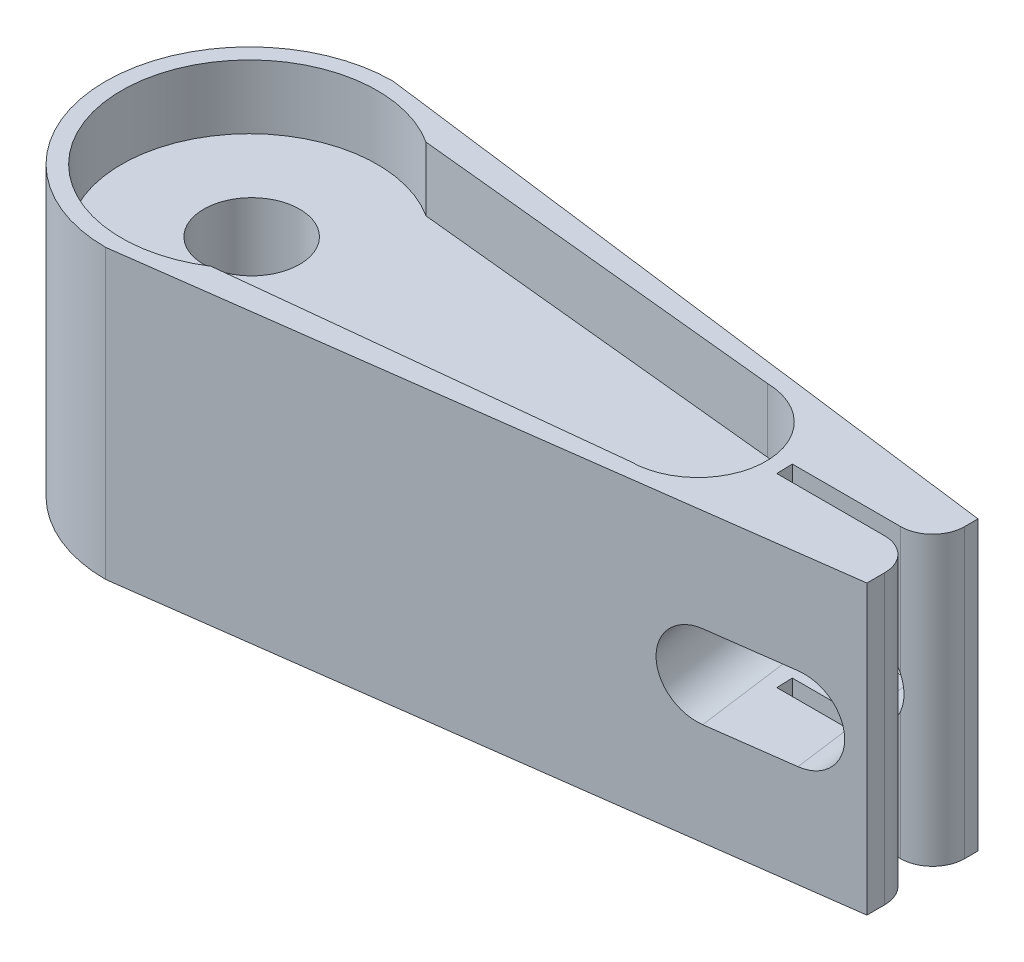
ISO-10303-21;
HEADER;
FILE_DESCRIPTION(('STEP AP214'),'2;1');
FILE_NAME('part.step','',(''),(''),'','','');
FILE_SCHEMA(('AUTOMOTIVE_DESIGN { 1 0 10303 214 1 1 1 1 }'));
ENDSEC;
DATA;
#1=APPLICATION_CONTEXT('core data for automotive mechanical design processes');
#2=APPLICATION_PROTOCOL_DEFINITION('international standard','automotive_design',2000,#1);
#3=PRODUCT_CONTEXT('',#1,'mechanical');
#4=PRODUCT('Part','Part','',(#3));
#5=PRODUCT_RELATED_PRODUCT_CATEGORY('part','',(#4));
#6=PRODUCT_DEFINITION_FORMATION('','',#4);
#7=PRODUCT_DEFINITION_CONTEXT('part definition',#1,'design');
#8=PRODUCT_DEFINITION('design','',#6,#7);
#9=PRODUCT_DEFINITION_SHAPE('','',#8);
#10=(LENGTH_UNIT() NAMED_UNIT(*) SI_UNIT(.MILLI.,.METRE.));
#11=(NAMED_UNIT(*) PLANE_ANGLE_UNIT() SI_UNIT($,.RADIAN.));
#12=(NAMED_UNIT(*) SI_UNIT($,.STERADIAN.) SOLID_ANGLE_UNIT());
#13=UNCERTAINTY_MEASURE_WITH_UNIT(LENGTH_MEASURE(1.E-05),#10,'distance_accuracy_value','');
#14=(GEOMETRIC_REPRESENTATION_CONTEXT(3) GLOBAL_UNCERTAINTY_ASSIGNED_CONTEXT((#13)) GLOBAL_UNIT_ASSIGNED_CONTEXT((#10,
#11,#12)) REPRESENTATION_CONTEXT('',''));
#15=CARTESIAN_POINT('',(0.,0.,0.));
#16=DIRECTION('',(0.,0.,1.));
#17=DIRECTION('',(1.,0.,0.));
#18=AXIS2_PLACEMENT_3D('',#15,#16,#17);
#19=CARTESIAN_POINT('',(-10.3510938888808,9.,0.338638234521338));
#20=DIRECTION('',(0.999465286624354,0.,-0.0326977190779233));
#21=DIRECTION('',(-0.0326977190779233,0.,-0.999465286624354));
#22=AXIS2_PLACEMENT_3D('',#19,#20,#21);
#23=PLANE('',#22);
#24=DIRECTION('',(-0.0326977190779233,0.,-0.999465286624354));
#25=VECTOR('',#24,1.);
#26=CARTESIAN_POINT('',(-10.3510938888808,3.2,0.338638234521338));
#27=LINE('',#26,#25);
#28=CARTESIAN_POINT('',(-10.3556294681616,3.2,0.200000000000035));
#29=VERTEX_POINT('',#28);
#30=CARTESIAN_POINT('',(-10.3719870743314,3.2,-0.300000000000064));
#31=VERTEX_POINT('',#30);
#32=EDGE_CURVE('E438',#29,#31,#27,.T.);
#33=ORIENTED_EDGE('',*,*,#32,.F.);
#34=DIRECTION('',(0.,-1.,0.));
#35=VECTOR('',#34,1.);
#36=CARTESIAN_POINT('',(-10.3556294681616,9.,0.200000000000035));
#37=LINE('',#36,#35);
#38=CARTESIAN_POINT('',(-10.3556294681616,0.,0.200000000000035));
#39=VERTEX_POINT('',#38);
#40=EDGE_CURVE('E311',#29,#39,#37,.T.);
#41=ORIENTED_EDGE('',*,*,#40,.T.);
#42=DIRECTION('',(0.0326977190779233,0.,0.999465286624354));
#43=VECTOR('',#42,1.);
#44=CARTESIAN_POINT('',(-10.3510938888808,0.,0.338638234521338));
#45=LINE('',#44,#43);
#46=CARTESIAN_POINT('',(-10.3719870743314,0.,-0.300000000000064));
#47=VERTEX_POINT('',#46);
#48=EDGE_CURVE('E452',#47,#39,#45,.T.);
#49=ORIENTED_EDGE('',*,*,#48,.F.);
#50=DIRECTION('',(0.,-1.,0.));
#51=VECTOR('',#50,1.);
#52=CARTESIAN_POINT('',(-10.3719870743314,9.,-0.300000000000064));
#53=LINE('',#52,#51);
#54=EDGE_CURVE('E344',#31,#47,#53,.T.);
#55=ORIENTED_EDGE('',*,*,#54,.F.);
#56=EDGE_LOOP('',(#33,#41,#49,#55));
#57=FACE_BOUND('',#56,.T.);
#58=ADVANCED_FACE('F45',(#57),#23,.T.);
#59=CARTESIAN_POINT('',(0.,9.,-0.299999999999906));
#60=DIRECTION('',(0.,0.,1.));
#61=DIRECTION('',(1.,0.,0.));
#62=AXIS2_PLACEMENT_3D('',#59,#60,#61);
#63=PLANE('',#62);
#64=CARTESIAN_POINT('',(-8.19153680982325,4.5,-0.300000000000031));
#65=DIRECTION('',(0.,0.,1.));
#66=DIRECTION('',(1.,0.,0.));
#67=AXIS2_PLACEMENT_3D('',#64,#65,#66);
#68=ELLIPSE('',#67,1.31161285612062,1.3);
#69=CARTESIAN_POINT('',(-8.19153680982325,3.2,-0.300000000000031));
#70=VERTEX_POINT('',#69);
#71=CARTESIAN_POINT('',(-6.98015973110085,4.00156695437617,-0.300000000000012));
#72=VERTEX_POINT('',#71);
#73=EDGE_CURVE('E247',#70,#72,#68,.T.);
#74=ORIENTED_EDGE('',*,*,#73,.F.);
#75=DIRECTION('',(1.,0.,0.));
#76=VECTOR('',#75,1.);
#77=CARTESIAN_POINT('',(0.,3.2,-0.299999999999906));
#78=LINE('',#77,#76);
#79=EDGE_CURVE('E444',#31,#70,#78,.T.);
#80=ORIENTED_EDGE('',*,*,#79,.F.);
#81=ORIENTED_EDGE('',*,*,#54,.T.);
#82=DIRECTION('',(-1.,0.,0.));
#83=VECTOR('',#82,1.);
#84=CARTESIAN_POINT('',(0.,0.,-0.299999999999906));
#85=LINE('',#84,#83);
#86=CARTESIAN_POINT('',(-6.98015973110085,0.,-0.300000000000012));
#87=VERTEX_POINT('',#86);
#88=EDGE_CURVE('E422',#87,#47,#85,.T.);
#89=ORIENTED_EDGE('',*,*,#88,.F.);
#90=DIRECTION('',(0.,-1.,0.));
#91=VECTOR('',#90,1.);
#92=CARTESIAN_POINT('',(-6.98015973110085,9.,-0.300000000000012));
#93=LINE('',#92,#91);
#94=EDGE_CURVE('E281',#87,#72,#93,.F.);
#95=ORIENTED_EDGE('',*,*,#94,.T.);
#96=EDGE_LOOP('',(#74,#80,#81,#89,#95));
#97=FACE_BOUND('',#96,.T.);
#98=ADVANCED_FACE('F419',(#97),#63,.T.);
#99=CARTESIAN_POINT('',(0.,9.,0.199999999999957));
#100=DIRECTION('',(0.,0.,-1.));
#101=DIRECTION('',(-1.,0.,0.));
#102=AXIS2_PLACEMENT_3D('',#99,#100,#101);
#103=PLANE('',#102);
#104=CARTESIAN_POINT('',(-8.12455597230381,4.5,0.200000000000018));
#105=DIRECTION('',(0.,0.,-1.));
#106=DIRECTION('',(1.,0.,0.));
#107=AXIS2_PLACEMENT_3D('',#104,#105,#106);
#108=ELLIPSE('',#107,1.31161285612062,1.3);
#109=CARTESIAN_POINT('',(-6.98012046216751,3.86489598525478,0.20000000000001));
#110=VERTEX_POINT('',#109);
#111=CARTESIAN_POINT('',(-8.12455597230381,3.2,0.200000000000018));
#112=VERTEX_POINT('',#111);
#113=EDGE_CURVE('E256',#110,#112,#108,.T.);
#114=ORIENTED_EDGE('',*,*,#113,.F.);
#115=DIRECTION('',(0.,-1.,0.));
#116=VECTOR('',#115,1.);
#117=CARTESIAN_POINT('',(-6.98012046216751,9.,0.20000000000001));
#118=LINE('',#117,#116);
#119=CARTESIAN_POINT('',(-6.98012046216751,0.,0.20000000000001));
#120=VERTEX_POINT('',#119);
#121=EDGE_CURVE('E380',#110,#120,#118,.T.);
#122=ORIENTED_EDGE('',*,*,#121,.T.);
#123=DIRECTION('',(1.,0.,0.));
#124=VECTOR('',#123,1.);
#125=CARTESIAN_POINT('',(0.,0.,0.199999999999957));
#126=LINE('',#125,#124);
#127=EDGE_CURVE('E313',#39,#120,#126,.T.);
#128=ORIENTED_EDGE('',*,*,#127,.F.);
#129=ORIENTED_EDGE('',*,*,#40,.F.);
#130=DIRECTION('',(-1.,0.,0.));
#131=VECTOR('',#130,1.);
#132=CARTESIAN_POINT('',(0.,3.2,0.199999999999957));
#133=LINE('',#132,#131);
#134=EDGE_CURVE('E11',#112,#29,#133,.T.);
#135=ORIENTED_EDGE('',*,*,#134,.F.);
#136=EDGE_LOOP('',(#114,#122,#128,#129,#135));
#137=FACE_BOUND('',#136,.T.);
#138=ADVANCED_FACE('F309',(#137),#103,.T.);
#139=CARTESIAN_POINT('',(-26.9871144134073,7.,0.));
#140=DIRECTION('',(0.,-1.,0.));
#141=DIRECTION('',(0.,0.,-1.));
#142=AXIS2_PLACEMENT_3D('',#139,#140,#141);
#143=CYLINDRICAL_SURFACE('',#142,1.5);
#144=CARTESIAN_POINT('',(-26.9871144134073,7.,0.));
#145=DIRECTION('',(0.,1.,0.));
#146=DIRECTION('',(0.,0.,1.));
#147=AXIS2_PLACEMENT_3D('',#144,#145,#146);
#148=CIRCLE('',#147,1.5);
#149=CARTESIAN_POINT('',(-26.9871144134073,7.,1.5));
#150=VERTEX_POINT('',#149);
#151=EDGE_CURVE('E361',#150,#150,#148,.T.);
#152=ORIENTED_EDGE('',*,*,#151,.T.);
#153=EDGE_LOOP('',(#152));
#154=FACE_BOUND('',#153,.T.);
#155=CARTESIAN_POINT('',(-26.9871144134073,0.,0.));
#156=DIRECTION('',(0.,1.,0.));
#157=DIRECTION('',(0.,0.,1.));
#158=AXIS2_PLACEMENT_3D('',#155,#156,#157);
#159=CIRCLE('',#158,1.5);
#160=CARTESIAN_POINT('',(-26.9871144134073,0.,1.5));
#161=VERTEX_POINT('',#160);
#162=EDGE_CURVE('E349',#161,#161,#159,.T.);
#163=ORIENTED_EDGE('',*,*,#162,.F.);
#164=EDGE_LOOP('',(#163));
#165=FACE_BOUND('',#164,.T.);
#166=ADVANCED_FACE('F562',(#154,#165),#143,.F.);
#167=CARTESIAN_POINT('',(0.,7.,0.));
#168=DIRECTION('',(0.,1.,0.));
#169=DIRECTION('',(0.,0.,1.));
#170=AXIS2_PLACEMENT_3D('',#167,#168,#169);
#171=PLANE('',#170);
#172=ORIENTED_EDGE('',*,*,#151,.F.);
#173=EDGE_LOOP('',(#172));
#174=FACE_BOUND('',#173,.T.);
#175=CARTESIAN_POINT('',(-26.9871144111105,7.,0.0716479314063977));
#176=DIRECTION('',(0.,1.,0.));
#177=DIRECTION('',(0.,0.,1.));
#178=AXIS2_PLACEMENT_3D('',#175,#176,#177);
#179=CIRCLE('',#178,4.00017684495756);
#180=CARTESIAN_POINT('',(-24.8217817734605,7.,-3.29179514961377));
#181=VERTEX_POINT('',#180);
#182=CARTESIAN_POINT('',(-24.8217479106025,7.,3.43506921180117));
#183=VERTEX_POINT('',#182);
#184=EDGE_CURVE('E365',#181,#183,#179,.T.);
#185=ORIENTED_EDGE('',*,*,#184,.T.);
#186=DIRECTION('',(-0.994303481764952,0.,0.10658605044796));
#187=VECTOR('',#186,1.);
#188=CARTESIAN_POINT('',(0.0820551859234197,7.,0.765463742371819));
#189=LINE('',#188,#187);
#190=CARTESIAN_POINT('',(-12.9871602464953,7.,2.16644048734145));
#191=VERTEX_POINT('',#190);
#192=EDGE_CURVE('E369',#191,#183,#189,.T.);
#193=ORIENTED_EDGE('',*,*,#192,.F.);
#194=CARTESIAN_POINT('',(-12.9871602464953,7.,0.0358235169116221));
#195=DIRECTION('',(0.,1.,0.));
#196=DIRECTION('',(0.,0.,1.));
#197=AXIS2_PLACEMENT_3D('',#194,#195,#196);
#198=CIRCLE('',#197,2.13061697043081);
#199=CARTESIAN_POINT('',(-12.9397621783685,7.,-2.09426617552422));
#200=VERTEX_POINT('',#199);
#201=EDGE_CURVE('E373',#191,#200,#198,.T.);
#202=ORIENTED_EDGE('',*,*,#201,.T.);
#203=DIRECTION('',(0.994959561797014,0.,0.100276968386042));
#204=VECTOR('',#203,1.);
#205=CARTESIAN_POINT('',(0.0788327420462111,7.,-0.782187492741088));
#206=LINE('',#205,#204);
#207=EDGE_CURVE('E377',#181,#200,#206,.T.);
#208=ORIENTED_EDGE('',*,*,#207,.F.);
#209=EDGE_LOOP('',(#185,#193,#202,#208));
#210=FACE_BOUND('',#209,.T.);
#211=ADVANCED_FACE('F551',(#174,#210),#171,.T.);
#212=CARTESIAN_POINT('',(0.,0.,0.));
#213=DIRECTION('',(0.,1.,0.));
#214=DIRECTION('',(0.,0.,1.));
#215=AXIS2_PLACEMENT_3D('',#212,#213,#214);
#216=PLANE('',#215);
#217=ORIENTED_EDGE('',*,*,#162,.T.);
#218=EDGE_LOOP('',(#217));
#219=FACE_BOUND('',#218,.T.);
#220=ORIENTED_EDGE('',*,*,#127,.T.);
#221=CARTESIAN_POINT('',(-6.9801204621675,0.,1.20000000000001));
#222=DIRECTION('',(0.,1.,0.));
#223=DIRECTION('',(0.,0.,1.));
#224=AXIS2_PLACEMENT_3D('',#221,#222,#223);
#225=CIRCLE('',#224,1.);
#226=CARTESIAN_POINT('',(-5.9801204779192,0.,1.19982250800737));
#227=VERTEX_POINT('',#226);
#228=EDGE_CURVE('E389',#120,#227,#225,.F.);
#229=ORIENTED_EDGE('',*,*,#228,.T.);
#230=DIRECTION('',(0.000177491992637757,0.,0.999999984248296));
#231=VECTOR('',#230,1.);
#232=CARTESIAN_POINT('',(-5.98033324840943,0.,0.00106146128161784));
#233=LINE('',#232,#231);
#234=CARTESIAN_POINT('',(-5.98002152379045,0.,1.75733569898175));
#235=VERTEX_POINT('',#234);
#236=EDGE_CURVE('E512',#227,#235,#233,.T.);
#237=ORIENTED_EDGE('',*,*,#236,.T.);
#238=DIRECTION('',(0.991146125118836,0.,-0.13277559512921));
#239=VECTOR('',#238,1.);
#240=CARTESIAN_POINT('',(0.125841462948721,0.,0.939384065720302));
#241=LINE('',#240,#239);
#242=CARTESIAN_POINT('',(-26.9871144111105,0.,4.5714810498644));
#243=VERTEX_POINT('',#242);
#244=EDGE_CURVE('E509',#243,#235,#241,.T.);
#245=ORIENTED_EDGE('',*,*,#244,.F.);
#246=CARTESIAN_POINT('',(-26.9871144111105,0.,0.0716479314063977));
#247=DIRECTION('',(0.,1.,0.));
#248=DIRECTION('',(0.,0.,1.));
#249=AXIS2_PLACEMENT_3D('',#246,#247,#248);
#250=CIRCLE('',#249,4.499833118458);
#251=CARTESIAN_POINT('',(-26.9871144111105,0.,-4.4281851870516));
#252=VERTEX_POINT('',#251);
#253=EDGE_CURVE('E505',#252,#243,#250,.T.);
#254=ORIENTED_EDGE('',*,*,#253,.F.);
#255=DIRECTION('',(0.991786141384125,0.,0.127907191972889));
#256=VECTOR('',#255,1.);
#257=CARTESIAN_POINT('',(0.120228498103905,0.,-0.932245922841887));
#258=LINE('',#257,#256);
#259=CARTESIAN_POINT('',(-5.98015973110084,0.,-1.71899166951373));
#260=VERTEX_POINT('',#259);
#261=EDGE_CURVE('E501',#252,#260,#258,.T.);
#262=ORIENTED_EDGE('',*,*,#261,.T.);
#263=DIRECTION('',(0.,0.,-1.));
#264=VECTOR('',#263,1.);
#265=CARTESIAN_POINT('',(-5.98015973110084,0.,0.));
#266=LINE('',#265,#264);
#267=CARTESIAN_POINT('',(-5.98015973110084,0.,-1.30000000000001));
#268=VERTEX_POINT('',#267);
#269=EDGE_CURVE('E498',#268,#260,#266,.T.);
#270=ORIENTED_EDGE('',*,*,#269,.F.);
#271=CARTESIAN_POINT('',(-6.98015973110084,0.,-1.30000000000001));
#272=DIRECTION('',(0.,1.,0.));
#273=DIRECTION('',(0.,0.,1.));
#274=AXIS2_PLACEMENT_3D('',#271,#272,#273);
#275=CIRCLE('',#274,1.);
#276=EDGE_CURVE('E386',#268,#87,#275,.F.);
#277=ORIENTED_EDGE('',*,*,#276,.T.);
#278=ORIENTED_EDGE('',*,*,#88,.T.);
#279=ORIENTED_EDGE('',*,*,#48,.T.);
#280=EDGE_LOOP('',(#220,#229,#237,#245,#254,#262,#270,#277,#278,#279));
#281=FACE_BOUND('',#280,.T.);
#282=ADVANCED_FACE('F517',(#219,#281),#216,.F.);
#283=DIRECTION('',(0.0326977190779233,0.,0.999465286624354));
#284=VECTOR('',#283,1.);
#285=CARTESIAN_POINT('',(-10.3510938888808,5.8,0.338638234521338));
#286=LINE('',#285,#284);
#287=CARTESIAN_POINT('',(-10.3719870743314,5.8,-0.300000000000064));
#288=VERTEX_POINT('',#287);
#289=CARTESIAN_POINT('',(-10.3556294681616,5.8,0.200000000000035));
#290=VERTEX_POINT('',#289);
#291=EDGE_CURVE('E286',#288,#290,#286,.T.);
#292=ORIENTED_EDGE('',*,*,#291,.F.);
#293=CARTESIAN_POINT('',(-10.3719870743314,9.,-0.300000000000064));
#294=VERTEX_POINT('',#293);
#295=EDGE_CURVE('E345',#294,#288,#53,.T.);
#296=ORIENTED_EDGE('',*,*,#295,.F.);
#297=DIRECTION('',(0.0326977190779233,0.,0.999465286624354));
#298=VECTOR('',#297,1.);
#299=CARTESIAN_POINT('',(-10.3510938888808,9.,0.338638234521338));
#300=LINE('',#299,#298);
#301=CARTESIAN_POINT('',(-10.3556294681616,9.,0.200000000000035));
#302=VERTEX_POINT('',#301);
#303=EDGE_CURVE('E467',#294,#302,#300,.T.);
#304=ORIENTED_EDGE('',*,*,#303,.T.);
#305=EDGE_CURVE('E318',#302,#290,#37,.T.);
#306=ORIENTED_EDGE('',*,*,#305,.T.);
#307=EDGE_LOOP('',(#292,#296,#304,#306));
#308=FACE_BOUND('',#307,.T.);
#309=ADVANCED_FACE('F543',(#308),#23,.T.);
#310=CARTESIAN_POINT('',(-6.98015973110085,4.99843304562384,-0.300000000000012));
#311=VERTEX_POINT('',#310);
#312=CARTESIAN_POINT('',(-8.19153680982325,5.8,-0.300000000000031));
#313=VERTEX_POINT('',#312);
#314=EDGE_CURVE('E244',#311,#313,#68,.T.);
#315=ORIENTED_EDGE('',*,*,#314,.F.);
#316=CARTESIAN_POINT('',(-6.98015973110085,9.,-0.300000000000012));
#317=VERTEX_POINT('',#316);
#318=EDGE_CURVE('E403',#311,#317,#93,.F.);
#319=ORIENTED_EDGE('',*,*,#318,.T.);
#320=DIRECTION('',(-1.,0.,0.));
#321=VECTOR('',#320,1.);
#322=CARTESIAN_POINT('',(0.,9.,-0.299999999999906));
#323=LINE('',#322,#321);
#324=EDGE_CURVE('E471',#317,#294,#323,.T.);
#325=ORIENTED_EDGE('',*,*,#324,.T.);
#326=ORIENTED_EDGE('',*,*,#295,.T.);
#327=DIRECTION('',(-1.,0.,0.));
#328=VECTOR('',#327,1.);
#329=CARTESIAN_POINT('',(0.,5.80000000000001,-0.299999999999906));
#330=LINE('',#329,#328);
#331=EDGE_CURVE('E431',#313,#288,#330,.T.);
#332=ORIENTED_EDGE('',*,*,#331,.F.);
#333=EDGE_LOOP('',(#315,#319,#325,#326,#332));
#334=FACE_BOUND('',#333,.T.);
#335=ADVANCED_FACE('F430',(#334),#63,.T.);
#336=CARTESIAN_POINT('',(-5.98015973110084,9.,0.));
#337=DIRECTION('',(-1.,0.,0.));
#338=DIRECTION('',(0.,0.,1.));
#339=AXIS2_PLACEMENT_3D('',#336,#337,#338);
#340=PLANE('',#339);
#341=DIRECTION('',(0.,0.,-1.));
#342=VECTOR('',#341,1.);
#343=CARTESIAN_POINT('',(-5.98015973110084,9.,0.));
#344=LINE('',#343,#342);
#345=CARTESIAN_POINT('',(-5.98015973110084,9.,-1.30000000000001));
#346=VERTEX_POINT('',#345);
#347=CARTESIAN_POINT('',(-5.98015973110084,9.,-1.71899166951373));
#348=VERTEX_POINT('',#347);
#349=EDGE_CURVE('E474',#346,#348,#344,.T.);
#350=ORIENTED_EDGE('',*,*,#349,.F.);
#351=DIRECTION('',(0.,-1.,0.));
#352=VECTOR('',#351,1.);
#353=CARTESIAN_POINT('',(-5.98015973110084,0.,-1.30000000000001));
#354=LINE('',#353,#352);
#355=EDGE_CURVE('E400',#346,#268,#354,.T.);
#356=ORIENTED_EDGE('',*,*,#355,.T.);
#357=ORIENTED_EDGE('',*,*,#269,.T.);
#358=DIRECTION('',(0.,-1.,0.));
#359=VECTOR('',#358,1.);
#360=CARTESIAN_POINT('',(-5.98015973110084,9.,-1.71899166951373));
#361=LINE('',#360,#359);
#362=EDGE_CURVE('E340',#348,#260,#361,.T.);
#363=ORIENTED_EDGE('',*,*,#362,.F.);
#364=EDGE_LOOP('',(#350,#356,#357,#363));
#365=FACE_BOUND('',#364,.T.);
#366=ADVANCED_FACE('F540',(#365),#340,.F.);
#367=CARTESIAN_POINT('',(0.120228498103905,9.,-0.932245922841887));
#368=DIRECTION('',(0.127907191972889,0.,-0.991786141384124));
#369=DIRECTION('',(-0.991786141384125,0.,-0.127907191972889));
#370=AXIS2_PLACEMENT_3D('',#367,#368,#369);
#371=PLANE('',#370);
#372=CARTESIAN_POINT('',(-8.42384582205628,4.5,-2.03414532302325));
#373=DIRECTION('',(0.127907191972889,0.,-0.991786141384124));
#374=DIRECTION('',(0.991786141384125,0.,0.127907191972889));
#375=AXIS2_PLACEMENT_3D('',#372,#373,#374);
#376=ELLIPSE('',#375,1.3457249934378,1.3);
#377=CARTESIAN_POINT('',(-8.42384582205628,5.8,-2.03414532302325));
#378=VERTEX_POINT('',#377);
#379=CARTESIAN_POINT('',(-8.42384582205628,3.2,-2.03414532302325));
#380=VERTEX_POINT('',#379);
#381=EDGE_CURVE('E298',#378,#380,#376,.T.);
#382=ORIENTED_EDGE('',*,*,#381,.F.);
#383=DIRECTION('',(0.991786141384125,0.,0.127907191972889));
#384=VECTOR('',#383,1.);
#385=CARTESIAN_POINT('',(0.120228498103906,5.80000000000001,-0.932245922841887));
#386=LINE('',#385,#384);
#387=CARTESIAN_POINT('',(-11.1459864809552,5.8,-2.38521028885255));
#388=VERTEX_POINT('',#387);
#389=EDGE_CURVE('E434',#388,#378,#386,.T.);
#390=ORIENTED_EDGE('',*,*,#389,.F.);
#391=CARTESIAN_POINT('',(-11.1459864809552,4.5,-2.38521028885255));
#392=DIRECTION('',(0.127907191972889,0.,-0.991786141384124));
#393=DIRECTION('',(0.991786141384125,0.,0.127907191972889));
#394=AXIS2_PLACEMENT_3D('',#391,#392,#393);
#395=ELLIPSE('',#394,1.3457249934378,1.3);
#396=CARTESIAN_POINT('',(-11.1459864809552,3.2,-2.38521028885255));
#397=VERTEX_POINT('',#396);
#398=EDGE_CURVE('E213',#397,#388,#395,.T.);
#399=ORIENTED_EDGE('',*,*,#398,.F.);
#400=DIRECTION('',(-0.991786141384125,0.,-0.127907191972889));
#401=VECTOR('',#400,1.);
#402=CARTESIAN_POINT('',(0.120228498103904,3.2,-0.932245922841887));
#403=LINE('',#402,#401);
#404=EDGE_CURVE('E447',#380,#397,#403,.T.);
#405=ORIENTED_EDGE('',*,*,#404,.F.);
#406=EDGE_LOOP('',(#382,#390,#399,#405));
#407=FACE_BOUND('',#406,.T.);
#408=ORIENTED_EDGE('',*,*,#261,.F.);
#409=DIRECTION('',(0.,-1.,0.));
#410=VECTOR('',#409,1.);
#411=CARTESIAN_POINT('',(-26.9871144111105,9.,-4.4281851870516));
#412=LINE('',#411,#410);
#413=CARTESIAN_POINT('',(-26.9871144111105,9.,-4.4281851870516));
#414=VERTEX_POINT('',#413);
#415=EDGE_CURVE('E337',#414,#252,#412,.T.);
#416=ORIENTED_EDGE('',*,*,#415,.F.);
#417=DIRECTION('',(0.991786141384125,0.,0.127907191972889));
#418=VECTOR('',#417,1.);
#419=CARTESIAN_POINT('',(0.120228498103905,9.,-0.932245922841887));
#420=LINE('',#419,#418);
#421=EDGE_CURVE('E477',#414,#348,#420,.T.);
#422=ORIENTED_EDGE('',*,*,#421,.T.);
#423=ORIENTED_EDGE('',*,*,#362,.T.);
#424=EDGE_LOOP('',(#408,#416,#422,#423));
#425=FACE_BOUND('',#424,.T.);
#426=ADVANCED_FACE('F538',(#407,#425),#371,.T.);
#427=CARTESIAN_POINT('',(-26.9871144111105,9.,0.0716479314063977));
#428=DIRECTION('',(0.,-1.,0.));
#429=DIRECTION('',(0.,0.,-1.));
#430=AXIS2_PLACEMENT_3D('',#427,#428,#429);
#431=CYLINDRICAL_SURFACE('',#430,4.499833118458);
#432=ORIENTED_EDGE('',*,*,#253,.T.);
#433=DIRECTION('',(0.,-1.,0.));
#434=VECTOR('',#433,1.);
#435=CARTESIAN_POINT('',(-26.9871144111105,9.,4.5714810498644));
#436=LINE('',#435,#434);
#437=CARTESIAN_POINT('',(-26.9871144111105,9.,4.5714810498644));
#438=VERTEX_POINT('',#437);
#439=EDGE_CURVE('E333',#438,#243,#436,.T.);
#440=ORIENTED_EDGE('',*,*,#439,.F.);
#441=CARTESIAN_POINT('',(-26.9871144111105,9.,0.0716479314063977));
#442=DIRECTION('',(0.,1.,0.));
#443=DIRECTION('',(0.,0.,1.));
#444=AXIS2_PLACEMENT_3D('',#441,#442,#443);
#445=CIRCLE('',#444,4.499833118458);
#446=EDGE_CURVE('E481',#414,#438,#445,.T.);
#447=ORIENTED_EDGE('',*,*,#446,.F.);
#448=ORIENTED_EDGE('',*,*,#415,.T.);
#449=EDGE_LOOP('',(#432,#440,#447,#448));
#450=FACE_BOUND('',#449,.T.);
#451=ADVANCED_FACE('F568',(#450),#431,.T.);
#452=CARTESIAN_POINT('',(0.125841462948721,9.,0.939384065720302));
#453=DIRECTION('',(-0.13277559512921,0.,-0.991146125118836));
#454=DIRECTION('',(-0.991146125118836,0.,0.13277559512921));
#455=AXIS2_PLACEMENT_3D('',#452,#453,#454);
#456=PLANE('',#455);
#457=DIRECTION('',(-0.991146125118836,0.,0.13277559512921));
#458=VECTOR('',#457,1.);
#459=CARTESIAN_POINT('',(-7.88180380147507,5.8,2.01210163845963));
#460=LINE('',#459,#458);
#461=CARTESIAN_POINT('',(-7.88180380147507,5.8,2.01210163845963));
#462=VERTEX_POINT('',#461);
#463=CARTESIAN_POINT('',(-10.5097547110313,5.8,2.36414634422372));
#464=VERTEX_POINT('',#463);
#465=EDGE_CURVE('E220',#462,#464,#460,.T.);
#466=ORIENTED_EDGE('',*,*,#465,.F.);
#467=CARTESIAN_POINT('',(-7.88180380147507,4.5,2.01210163845963));
#468=DIRECTION('',(0.13277559512921,0.,0.991146125118836));
#469=DIRECTION('',(0.991146125118836,0.,-0.13277559512921));
#470=AXIS2_PLACEMENT_3D('',#467,#468,#469);
#471=CIRCLE('',#470,1.3);
#472=CARTESIAN_POINT('',(-7.88180380147507,3.2,2.01210163845963));
#473=VERTEX_POINT('',#472);
#474=EDGE_CURVE('E70',#473,#462,#471,.T.);
#475=ORIENTED_EDGE('',*,*,#474,.F.);
#476=DIRECTION('',(0.991146125118836,0.,-0.13277559512921));
#477=VECTOR('',#476,1.);
#478=CARTESIAN_POINT('',(-7.88180380147507,3.2,2.01210163845963));
#479=LINE('',#478,#477);
#480=CARTESIAN_POINT('',(-10.5097547110313,3.2,2.36414634422372));
#481=VERTEX_POINT('',#480);
#482=EDGE_CURVE('E229',#481,#473,#479,.T.);
#483=ORIENTED_EDGE('',*,*,#482,.F.);
#484=CARTESIAN_POINT('',(-10.5097547110313,4.5,2.36414634422372));
#485=DIRECTION('',(0.13277559512921,0.,0.991146125118836));
#486=DIRECTION('',(0.991146125118836,0.,-0.13277559512921));
#487=AXIS2_PLACEMENT_3D('',#484,#485,#486);
#488=CIRCLE('',#487,1.3);
#489=EDGE_CURVE('E210',#464,#481,#488,.T.);
#490=ORIENTED_EDGE('',*,*,#489,.F.);
#491=EDGE_LOOP('',(#466,#475,#483,#490));
#492=FACE_BOUND('',#491,.T.);
#493=ORIENTED_EDGE('',*,*,#244,.T.);
#494=DIRECTION('',(0.,-1.,0.));
#495=VECTOR('',#494,1.);
#496=CARTESIAN_POINT('',(-5.98002152379045,9.,1.75733569898175));
#497=LINE('',#496,#495);
#498=CARTESIAN_POINT('',(-5.98002152379045,9.,1.75733569898175));
#499=VERTEX_POINT('',#498);
#500=EDGE_CURVE('E323',#499,#235,#497,.T.);
#501=ORIENTED_EDGE('',*,*,#500,.F.);
#502=DIRECTION('',(0.991146125118836,0.,-0.13277559512921));
#503=VECTOR('',#502,1.);
#504=CARTESIAN_POINT('',(0.125841462948721,9.,0.939384065720302));
#505=LINE('',#504,#503);
#506=EDGE_CURVE('E485',#438,#499,#505,.T.);
#507=ORIENTED_EDGE('',*,*,#506,.F.);
#508=ORIENTED_EDGE('',*,*,#439,.T.);
#509=EDGE_LOOP('',(#493,#501,#507,#508));
#510=FACE_BOUND('',#509,.T.);
#511=ADVANCED_FACE('F226',(#492,#510),#456,.F.);
#512=CARTESIAN_POINT('',(-5.98033324840943,9.,0.00106146128161784));
#513=DIRECTION('',(0.999999984248296,0.,-0.000177491992637757));
#514=DIRECTION('',(-0.000177491992637757,0.,-0.999999984248296));
#515=AXIS2_PLACEMENT_3D('',#512,#513,#514);
#516=PLANE('',#515);
#517=ORIENTED_EDGE('',*,*,#236,.F.);
#518=DIRECTION('',(0.,-1.,0.));
#519=VECTOR('',#518,1.);
#520=CARTESIAN_POINT('',(-5.9801204779192,9.,1.19982250800737));
#521=LINE('',#520,#519);
#522=CARTESIAN_POINT('',(-5.9801204779192,9.,1.19982250800737));
#523=VERTEX_POINT('',#522);
#524=EDGE_CURVE('E392',#227,#523,#521,.F.);
#525=ORIENTED_EDGE('',*,*,#524,.T.);
#526=DIRECTION('',(0.000177491992637757,0.,0.999999984248296));
#527=VECTOR('',#526,1.);
#528=CARTESIAN_POINT('',(-5.98033324840943,9.,0.00106146128161784));
#529=LINE('',#528,#527);
#530=EDGE_CURVE('E489',#523,#499,#529,.T.);
#531=ORIENTED_EDGE('',*,*,#530,.T.);
#532=ORIENTED_EDGE('',*,*,#500,.T.);
#533=EDGE_LOOP('',(#517,#525,#531,#532));
#534=FACE_BOUND('',#533,.T.);
#535=ADVANCED_FACE('F527',(#534),#516,.T.);
#536=CARTESIAN_POINT('',(0.0788327420462111,9.,-0.782187492741088));
#537=DIRECTION('',(0.100276968386042,0.,-0.994959561797013));
#538=DIRECTION('',(-0.994959561797014,0.,-0.100276968386042));
#539=AXIS2_PLACEMENT_3D('',#536,#537,#538);
#540=PLANE('',#539);
#541=ORIENTED_EDGE('',*,*,#207,.T.);
#542=DIRECTION('',(0.,-1.,0.));
#543=VECTOR('',#542,1.);
#544=CARTESIAN_POINT('',(-12.9397621783685,9.,-2.09426617552422));
#545=LINE('',#544,#543);
#546=CARTESIAN_POINT('',(-12.9397621783685,9.,-2.09426617552422));
#547=VERTEX_POINT('',#546);
#548=EDGE_CURVE('E319',#547,#200,#545,.T.);
#549=ORIENTED_EDGE('',*,*,#548,.F.);
#550=DIRECTION('',(0.994959561797014,0.,0.100276968386042));
#551=VECTOR('',#550,1.);
#552=CARTESIAN_POINT('',(0.0788327420462111,9.,-0.782187492741088));
#553=LINE('',#552,#551);
#554=CARTESIAN_POINT('',(-24.8217817734605,9.,-3.29179514961377));
#555=VERTEX_POINT('',#554);
#556=EDGE_CURVE('E453',#555,#547,#553,.T.);
#557=ORIENTED_EDGE('',*,*,#556,.F.);
#558=DIRECTION('',(0.,-1.,0.));
#559=VECTOR('',#558,1.);
#560=CARTESIAN_POINT('',(-24.8217817734605,9.,-3.29179514961377));
#561=LINE('',#560,#559);
#562=EDGE_CURVE('E350',#555,#181,#561,.T.);
#563=ORIENTED_EDGE('',*,*,#562,.T.);
#564=EDGE_LOOP('',(#541,#549,#557,#563));
#565=FACE_BOUND('',#564,.T.);
#566=ADVANCED_FACE('F575',(#565),#540,.F.);
#567=CARTESIAN_POINT('',(-12.9871602464953,9.,0.0358235169116221));
#568=DIRECTION('',(0.,-1.,0.));
#569=DIRECTION('',(0.,0.,-1.));
#570=AXIS2_PLACEMENT_3D('',#567,#568,#569);
#571=CYLINDRICAL_SURFACE('',#570,2.13061697043081);
#572=ORIENTED_EDGE('',*,*,#548,.T.);
#573=ORIENTED_EDGE('',*,*,#201,.F.);
#574=DIRECTION('',(0.,-1.,0.));
#575=VECTOR('',#574,1.);
#576=CARTESIAN_POINT('',(-12.9871602464953,9.,2.16644048734145));
#577=LINE('',#576,#575);
#578=CARTESIAN_POINT('',(-12.9871602464953,9.,2.16644048734145));
#579=VERTEX_POINT('',#578);
#580=EDGE_CURVE('E325',#579,#191,#577,.T.);
#581=ORIENTED_EDGE('',*,*,#580,.F.);
#582=CARTESIAN_POINT('',(-12.9871602464953,9.,0.0358235169116221));
#583=DIRECTION('',(0.,1.,0.));
#584=DIRECTION('',(0.,0.,1.));
#585=AXIS2_PLACEMENT_3D('',#582,#583,#584);
#586=CIRCLE('',#585,2.13061697043081);
#587=EDGE_CURVE('E456',#579,#547,#586,.T.);
#588=ORIENTED_EDGE('',*,*,#587,.T.);
#589=EDGE_LOOP('',(#572,#573,#581,#588));
#590=FACE_BOUND('',#589,.T.);
#591=ADVANCED_FACE('F588',(#590),#571,.F.);
#592=CARTESIAN_POINT('',(0.0820551859234197,9.,0.765463742371819));
#593=DIRECTION('',(0.10658605044796,0.,0.994303481764951));
#594=DIRECTION('',(0.994303481764952,0.,-0.10658605044796));
#595=AXIS2_PLACEMENT_3D('',#592,#593,#594);
#596=PLANE('',#595);
#597=ORIENTED_EDGE('',*,*,#192,.T.);
#598=DIRECTION('',(0.,-1.,0.));
#599=VECTOR('',#598,1.);
#600=CARTESIAN_POINT('',(-24.8217479106025,9.,3.43506921180117));
#601=LINE('',#600,#599);
#602=CARTESIAN_POINT('',(-24.8217479106025,9.,3.43506921180117));
#603=VERTEX_POINT('',#602);
#604=EDGE_CURVE('E354',#603,#183,#601,.T.);
#605=ORIENTED_EDGE('',*,*,#604,.F.);
#606=DIRECTION('',(-0.994303481764952,0.,0.10658605044796));
#607=VECTOR('',#606,1.);
#608=CARTESIAN_POINT('',(0.0820551859234197,9.,0.765463742371819));
#609=LINE('',#608,#607);
#610=EDGE_CURVE('E460',#579,#603,#609,.T.);
#611=ORIENTED_EDGE('',*,*,#610,.F.);
#612=ORIENTED_EDGE('',*,*,#580,.T.);
#613=EDGE_LOOP('',(#597,#605,#611,#612));
#614=FACE_BOUND('',#613,.T.);
#615=ADVANCED_FACE('F583',(#614),#596,.F.);
#616=CARTESIAN_POINT('',(-26.9871144111105,9.,0.0716479314063977));
#617=DIRECTION('',(0.,-1.,0.));
#618=DIRECTION('',(0.,0.,-1.));
#619=AXIS2_PLACEMENT_3D('',#616,#617,#618);
#620=CYLINDRICAL_SURFACE('',#619,4.00017684495756);
#621=ORIENTED_EDGE('',*,*,#604,.T.);
#622=ORIENTED_EDGE('',*,*,#184,.F.);
#623=ORIENTED_EDGE('',*,*,#562,.F.);
#624=CARTESIAN_POINT('',(-26.9871144111105,9.,0.0716479314063977));
#625=DIRECTION('',(0.,1.,0.));
#626=DIRECTION('',(0.,0.,1.));
#627=AXIS2_PLACEMENT_3D('',#624,#625,#626);
#628=CIRCLE('',#627,4.00017684495756);
#629=EDGE_CURVE('E463',#555,#603,#628,.T.);
#630=ORIENTED_EDGE('',*,*,#629,.T.);
#631=EDGE_LOOP('',(#621,#622,#623,#630));
#632=FACE_BOUND('',#631,.T.);
#633=ADVANCED_FACE('F577',(#632),#620,.F.);
#634=CARTESIAN_POINT('',(-8.12455597230381,5.8,0.200000000000018));
#635=VERTEX_POINT('',#634);
#636=CARTESIAN_POINT('',(-6.98012046216751,5.13510401474522,0.20000000000001));
#637=VERTEX_POINT('',#636);
#638=EDGE_CURVE('E290',#635,#637,#108,.T.);
#639=ORIENTED_EDGE('',*,*,#638,.F.);
#640=DIRECTION('',(1.,0.,0.));
#641=VECTOR('',#640,1.);
#642=CARTESIAN_POINT('',(0.,5.80000000000001,0.199999999999957));
#643=LINE('',#642,#641);
#644=EDGE_CURVE('E55',#290,#635,#643,.T.);
#645=ORIENTED_EDGE('',*,*,#644,.F.);
#646=ORIENTED_EDGE('',*,*,#305,.F.);
#647=DIRECTION('',(1.,0.,0.));
#648=VECTOR('',#647,1.);
#649=CARTESIAN_POINT('',(0.,9.,0.199999999999957));
#650=LINE('',#649,#648);
#651=CARTESIAN_POINT('',(-6.98012046216751,9.,0.20000000000001));
#652=VERTEX_POINT('',#651);
#653=EDGE_CURVE('E355',#302,#652,#650,.T.);
#654=ORIENTED_EDGE('',*,*,#653,.T.);
#655=EDGE_CURVE('E296',#652,#637,#118,.T.);
#656=ORIENTED_EDGE('',*,*,#655,.T.);
#657=EDGE_LOOP('',(#639,#645,#646,#654,#656));
#658=FACE_BOUND('',#657,.T.);
#659=ADVANCED_FACE('F293',(#658),#103,.T.);
#660=CARTESIAN_POINT('',(0.,9.,0.));
#661=DIRECTION('',(0.,1.,0.));
#662=DIRECTION('',(0.,0.,1.));
#663=AXIS2_PLACEMENT_3D('',#660,#661,#662);
#664=PLANE('',#663);
#665=ORIENTED_EDGE('',*,*,#556,.T.);
#666=ORIENTED_EDGE('',*,*,#587,.F.);
#667=ORIENTED_EDGE('',*,*,#610,.T.);
#668=ORIENTED_EDGE('',*,*,#629,.F.);
#669=EDGE_LOOP('',(#665,#666,#667,#668));
#670=FACE_BOUND('',#669,.T.);
#671=ORIENTED_EDGE('',*,*,#530,.F.);
#672=CARTESIAN_POINT('',(-6.9801204621675,9.,1.20000000000001));
#673=DIRECTION('',(0.,1.,0.));
#674=DIRECTION('',(0.,0.,1.));
#675=AXIS2_PLACEMENT_3D('',#672,#673,#674);
#676=CIRCLE('',#675,1.);
#677=EDGE_CURVE('E398',#523,#652,#676,.T.);
#678=ORIENTED_EDGE('',*,*,#677,.T.);
#679=ORIENTED_EDGE('',*,*,#653,.F.);
#680=ORIENTED_EDGE('',*,*,#303,.F.);
#681=ORIENTED_EDGE('',*,*,#324,.F.);
#682=CARTESIAN_POINT('',(-6.98015973110084,9.,-1.30000000000001));
#683=DIRECTION('',(0.,1.,0.));
#684=DIRECTION('',(0.,0.,1.));
#685=AXIS2_PLACEMENT_3D('',#682,#683,#684);
#686=CIRCLE('',#685,1.);
#687=EDGE_CURVE('E395',#317,#346,#686,.T.);
#688=ORIENTED_EDGE('',*,*,#687,.T.);
#689=ORIENTED_EDGE('',*,*,#349,.T.);
#690=ORIENTED_EDGE('',*,*,#421,.F.);
#691=ORIENTED_EDGE('',*,*,#446,.T.);
#692=ORIENTED_EDGE('',*,*,#506,.T.);
#693=EDGE_LOOP('',(#671,#678,#679,#680,#681,#688,#689,#690,#691,#692));
#694=FACE_BOUND('',#693,.T.);
#695=ADVANCED_FACE('F270',(#670,#694),#664,.T.);
#696=CARTESIAN_POINT('',(-6.9801204621675,9.,1.20000000000001));
#697=DIRECTION('',(0.,-1.,0.));
#698=DIRECTION('',(0.,0.,-1.));
#699=AXIS2_PLACEMENT_3D('',#696,#697,#698);
#700=CYLINDRICAL_SURFACE('',#699,1.);
#701=CARTESIAN_POINT('',(-6.98012046216751,5.13510401474522,0.20000000000001));
#702=CARTESIAN_POINT('',(-6.95904345956542,5.09780377832566,0.200014296757551));
#703=CARTESIAN_POINT('',(-6.93975936299912,5.05949834464168,0.200666944346683));
#704=CARTESIAN_POINT('',(-6.90498591371769,4.98119748491952,0.202670649896926));
#705=CARTESIAN_POINT('',(-6.88949834449307,4.94120127491151,0.204022035179979));
#706=CARTESIAN_POINT('',(-6.86260329716199,4.86004459164974,0.206837937159572));
#707=CARTESIAN_POINT('',(-6.85117905999794,4.81888967431957,0.208301958145912));
#708=CARTESIAN_POINT('',(-6.83249566583251,4.73566105615867,0.210912555282528));
#709=CARTESIAN_POINT('',(-6.82523490862725,4.69358771478047,0.21205925330583));
#710=CARTESIAN_POINT('',(-6.81137061930063,4.57871842174661,0.214292231187141));
#711=CARTESIAN_POINT('',(-6.80891004555374,4.50536145464951,0.214755072151751));
#712=CARTESIAN_POINT('',(-6.81674984461392,4.35943235053978,0.213429638209824));
#713=CARTESIAN_POINT('',(-6.82704368951814,4.28685983120555,0.211642514861248));
#714=CARTESIAN_POINT('',(-6.85756277188384,4.15436600297043,0.207440170555184));
#715=CARTESIAN_POINT('',(-6.87622739251085,4.09407747442272,0.205145138748625));
#716=CARTESIAN_POINT('',(-6.91055095210549,4.00612150381108,0.202357583381518));
#717=CARTESIAN_POINT('',(-6.92305561485106,3.97719969051987,0.201537279942165));
#718=CARTESIAN_POINT('',(-6.95009032347647,3.92030611054049,0.200360004071762));
#719=CARTESIAN_POINT('',(-6.96462054783177,3.89233442784024,0.200003072497757));
#720=CARTESIAN_POINT('',(-6.98012046216751,3.86489598525478,0.20000000000001));
#721=B_SPLINE_CURVE_WITH_KNOTS('',3,(#701,#702,#703,#704,#705,#706,#707,#708,#709,#710,#711,
#712,#713,#714,#715,#716,#717,#718,#719,#720),.UNSPECIFIED.,.F.,.F.,(4,2,2,2,2,2,2,2,2,4),(0.,
0.128467821427106,0.256995877883833,0.384987504234524,0.512929904885901,0.731899985304106,
0.950758039829154,1.13951569767545,1.23400354974793,1.32849973256398),.UNSPECIFIED.);
#722=EDGE_CURVE('E248',#637,#110,#721,.T.);
#723=ORIENTED_EDGE('',*,*,#722,.F.);
#724=ORIENTED_EDGE('',*,*,#655,.F.);
#725=ORIENTED_EDGE('',*,*,#677,.F.);
#726=ORIENTED_EDGE('',*,*,#524,.F.);
#727=ORIENTED_EDGE('',*,*,#228,.F.);
#728=ORIENTED_EDGE('',*,*,#121,.F.);
#729=EDGE_LOOP('',(#723,#724,#725,#726,#727,#728));
#730=FACE_BOUND('',#729,.T.);
#731=ADVANCED_FACE('F258',(#730),#700,.T.);
#732=CARTESIAN_POINT('',(-6.98015973110084,9.,-1.30000000000001));
#733=DIRECTION('',(0.,1.,0.));
#734=DIRECTION('',(0.,0.,1.));
#735=AXIS2_PLACEMENT_3D('',#732,#733,#734);
#736=CYLINDRICAL_SURFACE('',#735,1.);
#737=CARTESIAN_POINT('',(-6.98015973110085,4.00156695437617,-0.300000000000012));
#738=CARTESIAN_POINT('',(-6.96361712062828,4.04104848338716,-0.300024793126372));
#739=CARTESIAN_POINT('',(-6.9490959725295,4.08136367287355,-0.300411272564589));
#740=CARTESIAN_POINT('',(-6.92416153683835,4.16324165161532,-0.301484570154203));
#741=CARTESIAN_POINT('',(-6.91374815737963,4.20480441294755,-0.302171381588235));
#742=CARTESIAN_POINT('',(-6.89709227845727,4.28876551824097,-0.303422436132016));
#743=CARTESIAN_POINT('',(-6.89085036547506,4.33116397883381,-0.303986661999498));
#744=CARTESIAN_POINT('',(-6.88256792190268,4.41635352227526,-0.304765499659138));
#745=CARTESIAN_POINT('',(-6.88052642599619,4.4591445126438,-0.304980191776817));
#746=CARTESIAN_POINT('',(-6.88070069481531,4.57444225151895,-0.304950856032882));
#747=CARTESIAN_POINT('',(-6.88685110888321,4.64697522138943,-0.304285408939792));
#748=CARTESIAN_POINT('',(-6.91115886881691,4.7897923705182,-0.302311554970247));
#749=CARTESIAN_POINT('',(-6.92927735284022,4.86008305889979,-0.301005232617749));
#750=CARTESIAN_POINT('',(-6.95733017098289,4.94007310009178,-0.300252686626494));
#751=CARTESIAN_POINT('',(-6.96165520264772,4.95184382923356,-0.300161398137716));
#752=CARTESIAN_POINT('',(-6.97064933890732,4.97524356066009,-0.300034820530752));
#753=CARTESIAN_POINT('',(-6.97531819108206,4.98687265975663,-0.29999949075037));
#754=CARTESIAN_POINT('',(-6.98015973110085,4.99843304562384,-0.299999999999975));
#755=B_SPLINE_CURVE_WITH_KNOTS('',3,(#737,#738,#739,#740,#741,#742,#743,#744,#745,#746,#747,
#748,#749,#750,#751,#752,#753,#754),.UNSPECIFIED.,.F.,.F.,(4,2,2,2,2,2,2,2,4),(0.,
0.128347490490862,0.256692110448703,0.385054771042599,0.513387928752694,0.730727326667474,
0.947364442543025,0.984983581301222,1.02257537168575),.UNSPECIFIED.);
#756=EDGE_CURVE('E274',#72,#311,#755,.T.);
#757=ORIENTED_EDGE('',*,*,#756,.F.);
#758=ORIENTED_EDGE('',*,*,#94,.F.);
#759=ORIENTED_EDGE('',*,*,#276,.F.);
#760=ORIENTED_EDGE('',*,*,#355,.F.);
#761=ORIENTED_EDGE('',*,*,#687,.F.);
#762=ORIENTED_EDGE('',*,*,#318,.F.);
#763=EDGE_LOOP('',(#757,#758,#759,#760,#761,#762));
#764=FACE_BOUND('',#763,.T.);
#765=ADVANCED_FACE('F47',(#764),#736,.T.);
#766=CARTESIAN_POINT('',(-9.14548919981571,4.5,-7.42108436771653));
#767=DIRECTION('',(0.13277559512921,0.,0.991146125118836));
#768=DIRECTION('',(0.991146125118836,0.,-0.13277559512921));
#769=AXIS2_PLACEMENT_3D('',#766,#767,#768);
#770=CYLINDRICAL_SURFACE('',#769,1.3);
#771=ORIENTED_EDGE('',*,*,#638,.T.);
#772=ORIENTED_EDGE('',*,*,#722,.T.);
#773=ORIENTED_EDGE('',*,*,#113,.T.);
#774=DIRECTION('',(0.13277559512921,0.,0.991146125118836));
#775=VECTOR('',#774,1.);
#776=CARTESIAN_POINT('',(-9.14548919981571,3.2,-7.42108436771653));
#777=LINE('',#776,#775);
#778=EDGE_CURVE('E236',#112,#473,#777,.T.);
#779=ORIENTED_EDGE('',*,*,#778,.T.);
#780=ORIENTED_EDGE('',*,*,#474,.T.);
#781=DIRECTION('',(0.13277559512921,0.,0.991146125118836));
#782=VECTOR('',#781,1.);
#783=CARTESIAN_POINT('',(-9.14548919981571,5.8,-7.42108436771653));
#784=LINE('',#783,#782);
#785=EDGE_CURVE('E222',#635,#462,#784,.T.);
#786=ORIENTED_EDGE('',*,*,#785,.F.);
#787=EDGE_LOOP('',(#771,#772,#773,#779,#780,#786));
#788=FACE_BOUND('',#787,.T.);
#789=ADVANCED_FACE('F267',(#788),#770,.F.);
#790=ORIENTED_EDGE('',*,*,#381,.T.);
#791=EDGE_CURVE('E239',#380,#70,#777,.T.);
#792=ORIENTED_EDGE('',*,*,#791,.T.);
#793=ORIENTED_EDGE('',*,*,#73,.T.);
#794=ORIENTED_EDGE('',*,*,#756,.T.);
#795=ORIENTED_EDGE('',*,*,#314,.T.);
#796=EDGE_CURVE('E217',#378,#313,#784,.T.);
#797=ORIENTED_EDGE('',*,*,#796,.F.);
#798=EDGE_LOOP('',(#790,#792,#793,#794,#795,#797));
#799=FACE_BOUND('',#798,.T.);
#800=ADVANCED_FACE('F261',(#799),#770,.F.);
#801=CARTESIAN_POINT('',(-9.14548919981571,3.2,-7.42108436771653));
#802=DIRECTION('',(0.,-1.,0.));
#803=DIRECTION('',(1.,0.,0.));
#804=AXIS2_PLACEMENT_3D('',#801,#802,#803);
#805=PLANE('',#804);
#806=ORIENTED_EDGE('',*,*,#404,.T.);
#807=DIRECTION('',(0.13277559512921,0.,0.991146125118836));
#808=VECTOR('',#807,1.);
#809=CARTESIAN_POINT('',(-11.7734401093719,3.2,-7.06903966195244));
#810=LINE('',#809,#808);
#811=EDGE_CURVE('E216',#397,#481,#810,.T.);
#812=ORIENTED_EDGE('',*,*,#811,.T.);
#813=ORIENTED_EDGE('',*,*,#482,.T.);
#814=ORIENTED_EDGE('',*,*,#778,.F.);
#815=ORIENTED_EDGE('',*,*,#134,.T.);
#816=ORIENTED_EDGE('',*,*,#32,.T.);
#817=ORIENTED_EDGE('',*,*,#79,.T.);
#818=ORIENTED_EDGE('',*,*,#791,.F.);
#819=EDGE_LOOP('',(#806,#812,#813,#814,#815,#816,#817,#818));
#820=FACE_BOUND('',#819,.T.);
#821=ADVANCED_FACE('F266',(#820),#805,.F.);
#822=CARTESIAN_POINT('',(-11.7734401093719,4.5,-7.06903966195244));
#823=DIRECTION('',(0.13277559512921,0.,0.991146125118836));
#824=DIRECTION('',(0.991146125118836,0.,-0.13277559512921));
#825=AXIS2_PLACEMENT_3D('',#822,#823,#824);
#826=CYLINDRICAL_SURFACE('',#825,1.3);
#827=ORIENTED_EDGE('',*,*,#398,.T.);
#828=DIRECTION('',(0.13277559512921,0.,0.991146125118836));
#829=VECTOR('',#828,1.);
#830=CARTESIAN_POINT('',(-11.7734401093719,5.8,-7.06903966195244));
#831=LINE('',#830,#829);
#832=EDGE_CURVE('E62',#388,#464,#831,.T.);
#833=ORIENTED_EDGE('',*,*,#832,.T.);
#834=ORIENTED_EDGE('',*,*,#489,.T.);
#835=ORIENTED_EDGE('',*,*,#811,.F.);
#836=EDGE_LOOP('',(#827,#833,#834,#835));
#837=FACE_BOUND('',#836,.T.);
#838=ADVANCED_FACE('F207',(#837),#826,.F.);
#839=CARTESIAN_POINT('',(-9.14548919981571,5.8,-7.42108436771653));
#840=DIRECTION('',(0.,1.,0.));
#841=DIRECTION('',(-1.,0.,0.));
#842=AXIS2_PLACEMENT_3D('',#839,#840,#841);
#843=PLANE('',#842);
#844=ORIENTED_EDGE('',*,*,#389,.T.);
#845=ORIENTED_EDGE('',*,*,#796,.T.);
#846=ORIENTED_EDGE('',*,*,#331,.T.);
#847=ORIENTED_EDGE('',*,*,#291,.T.);
#848=ORIENTED_EDGE('',*,*,#644,.T.);
#849=ORIENTED_EDGE('',*,*,#785,.T.);
#850=ORIENTED_EDGE('',*,*,#465,.T.);
#851=ORIENTED_EDGE('',*,*,#832,.F.);
#852=EDGE_LOOP('',(#844,#845,#846,#847,#848,#849,#850,#851));
#853=FACE_BOUND('',#852,.T.);
#854=ADVANCED_FACE('F221',(#853),#843,.F.);
#855=CLOSED_SHELL('',(#58,#98,#138,#166,#211,#282,#309,#335,#366,#426,#451,#511,#535,#566,#591,
#615,#633,#659,#695,#731,#765,#789,#800,#821,#838,#854));
#856=MANIFOLD_SOLID_BREP('B2',#855);
#857=ADVANCED_BREP_SHAPE_REPRESENTATION('',(#18,#856),#14);
#858=SHAPE_DEFINITION_REPRESENTATION(#9,#857);
ENDSEC;
END-ISO-10303-21;
